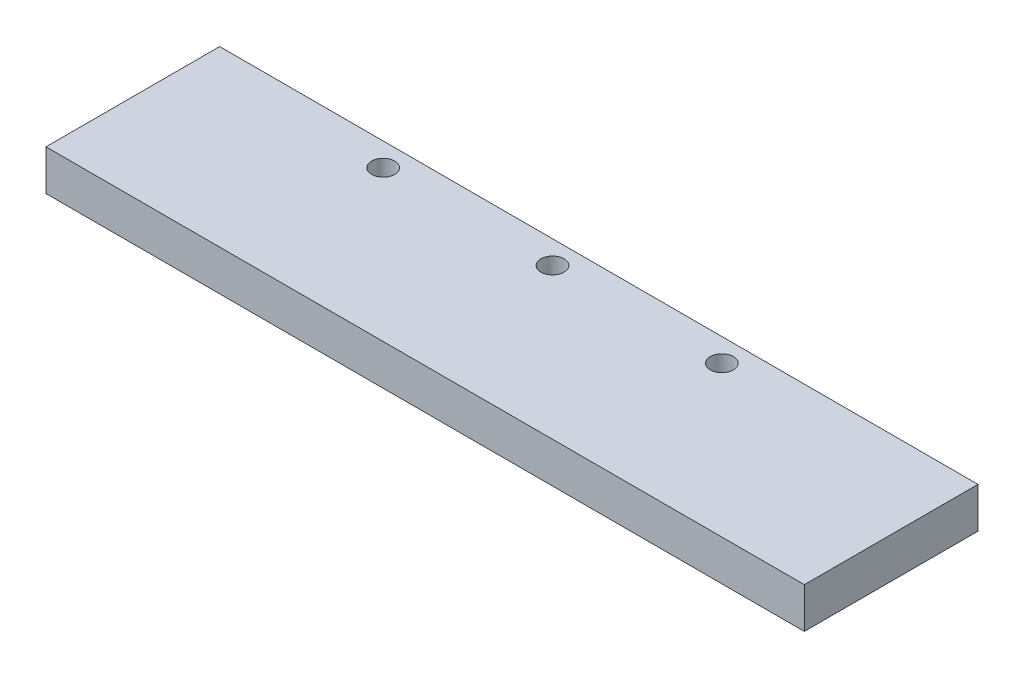
ISO-10303-21;
HEADER;
FILE_DESCRIPTION(('STEP AP214'),'2;1');
FILE_NAME('part.step','',(''),(''),'','','');
FILE_SCHEMA(('AUTOMOTIVE_DESIGN { 1 0 10303 214 1 1 1 1 }'));
ENDSEC;
DATA;
#1=APPLICATION_CONTEXT('core data for automotive mechanical design processes');
#2=APPLICATION_PROTOCOL_DEFINITION('international standard','automotive_design',2000,#1);
#3=PRODUCT_CONTEXT('',#1,'mechanical');
#4=PRODUCT('Part','Part','',(#3));
#5=PRODUCT_RELATED_PRODUCT_CATEGORY('part','',(#4));
#6=PRODUCT_DEFINITION_FORMATION('','',#4);
#7=PRODUCT_DEFINITION_CONTEXT('part definition',#1,'design');
#8=PRODUCT_DEFINITION('design','',#6,#7);
#9=PRODUCT_DEFINITION_SHAPE('','',#8);
#10=(LENGTH_UNIT() NAMED_UNIT(*) SI_UNIT(.MILLI.,.METRE.));
#11=(NAMED_UNIT(*) PLANE_ANGLE_UNIT() SI_UNIT($,.RADIAN.));
#12=(NAMED_UNIT(*) SI_UNIT($,.STERADIAN.) SOLID_ANGLE_UNIT());
#13=UNCERTAINTY_MEASURE_WITH_UNIT(LENGTH_MEASURE(1.E-05),#10,'distance_accuracy_value','');
#14=(GEOMETRIC_REPRESENTATION_CONTEXT(3) GLOBAL_UNCERTAINTY_ASSIGNED_CONTEXT((#13)) GLOBAL_UNIT_ASSIGNED_CONTEXT((#10,
#11,#12)) REPRESENTATION_CONTEXT('',''));
#15=CARTESIAN_POINT('',(0.,0.,0.));
#16=DIRECTION('',(0.,0.,1.));
#17=DIRECTION('',(1.,0.,0.));
#18=AXIS2_PLACEMENT_3D('',#15,#16,#17);
#19=CARTESIAN_POINT('',(-102.510460251046,7.,-65.1673640167364));
#20=DIRECTION('',(0.,0.,-1.));
#21=DIRECTION('',(-1.,0.,0.));
#22=AXIS2_PLACEMENT_3D('',#19,#20,#21);
#23=PLANE('',#22);
#24=DIRECTION('',(1.,0.,0.));
#25=VECTOR('',#24,1.);
#26=CARTESIAN_POINT('',(-102.510460251046,0.,-65.1673640167364));
#27=LINE('',#26,#25);
#28=CARTESIAN_POINT('',(-102.510460251046,0.,-65.1673640167364));
#29=VERTEX_POINT('',#28);
#30=CARTESIAN_POINT('',(28.4895397489539,0.,-65.1673640167364));
#31=VERTEX_POINT('',#30);
#32=EDGE_CURVE('E99',#29,#31,#27,.T.);
#33=ORIENTED_EDGE('',*,*,#32,.F.);
#34=DIRECTION('',(0.,-1.,0.));
#35=VECTOR('',#34,1.);
#36=CARTESIAN_POINT('',(-102.510460251046,7.,-65.1673640167364));
#37=LINE('',#36,#35);
#38=CARTESIAN_POINT('',(-102.510460251046,7.,-65.1673640167364));
#39=VERTEX_POINT('',#38);
#40=EDGE_CURVE('E11',#39,#29,#37,.T.);
#41=ORIENTED_EDGE('',*,*,#40,.F.);
#42=DIRECTION('',(1.,0.,0.));
#43=VECTOR('',#42,1.);
#44=CARTESIAN_POINT('',(-102.510460251046,7.,-65.1673640167364));
#45=LINE('',#44,#43);
#46=CARTESIAN_POINT('',(28.4895397489539,7.,-65.1673640167364));
#47=VERTEX_POINT('',#46);
#48=EDGE_CURVE('E93',#39,#47,#45,.T.);
#49=ORIENTED_EDGE('',*,*,#48,.T.);
#50=DIRECTION('',(0.,-1.,0.));
#51=VECTOR('',#50,1.);
#52=CARTESIAN_POINT('',(28.4895397489539,7.,-65.1673640167364));
#53=LINE('',#52,#51);
#54=EDGE_CURVE('E36',#47,#31,#53,.T.);
#55=ORIENTED_EDGE('',*,*,#54,.T.);
#56=EDGE_LOOP('',(#33,#41,#49,#55));
#57=FACE_BOUND('',#56,.T.);
#58=ADVANCED_FACE('F33',(#57),#23,.T.);
#59=CARTESIAN_POINT('',(-102.510460251046,7.,-65.1673640167364));
#60=DIRECTION('',(1.,0.,0.));
#61=DIRECTION('',(0.,0.,-1.));
#62=AXIS2_PLACEMENT_3D('',#59,#60,#61);
#63=PLANE('',#62);
#64=DIRECTION('',(0.,0.,1.));
#65=VECTOR('',#64,1.);
#66=CARTESIAN_POINT('',(-102.510460251046,0.,-65.1673640167364));
#67=LINE('',#66,#65);
#68=CARTESIAN_POINT('',(-102.510460251046,0.,-35.1673640167364));
#69=VERTEX_POINT('',#68);
#70=EDGE_CURVE('E66',#29,#69,#67,.T.);
#71=ORIENTED_EDGE('',*,*,#70,.T.);
#72=DIRECTION('',(0.,-1.,0.));
#73=VECTOR('',#72,1.);
#74=CARTESIAN_POINT('',(-102.510460251046,7.,-35.1673640167364));
#75=LINE('',#74,#73);
#76=CARTESIAN_POINT('',(-102.510460251046,7.,-35.1673640167364));
#77=VERTEX_POINT('',#76);
#78=EDGE_CURVE('E42',#77,#69,#75,.T.);
#79=ORIENTED_EDGE('',*,*,#78,.F.);
#80=DIRECTION('',(0.,0.,1.));
#81=VECTOR('',#80,1.);
#82=CARTESIAN_POINT('',(-102.510460251046,7.,-65.1673640167364));
#83=LINE('',#82,#81);
#84=EDGE_CURVE('E83',#39,#77,#83,.T.);
#85=ORIENTED_EDGE('',*,*,#84,.F.);
#86=ORIENTED_EDGE('',*,*,#40,.T.);
#87=EDGE_LOOP('',(#71,#79,#85,#86));
#88=FACE_BOUND('',#87,.T.);
#89=ADVANCED_FACE('F110',(#88),#63,.F.);
#90=CARTESIAN_POINT('',(-102.510460251046,7.,-35.1673640167364));
#91=DIRECTION('',(0.,0.,-1.));
#92=DIRECTION('',(-1.,0.,0.));
#93=AXIS2_PLACEMENT_3D('',#90,#91,#92);
#94=PLANE('',#93);
#95=DIRECTION('',(1.,0.,0.));
#96=VECTOR('',#95,1.);
#97=CARTESIAN_POINT('',(-102.510460251046,0.,-35.1673640167364));
#98=LINE('',#97,#96);
#99=CARTESIAN_POINT('',(28.4895397489539,0.,-35.1673640167364));
#100=VERTEX_POINT('',#99);
#101=EDGE_CURVE('E90',#69,#100,#98,.T.);
#102=ORIENTED_EDGE('',*,*,#101,.T.);
#103=DIRECTION('',(0.,-1.,0.));
#104=VECTOR('',#103,1.);
#105=CARTESIAN_POINT('',(28.4895397489539,7.,-35.1673640167364));
#106=LINE('',#105,#104);
#107=CARTESIAN_POINT('',(28.4895397489539,7.,-35.1673640167364));
#108=VERTEX_POINT('',#107);
#109=EDGE_CURVE('E87',#108,#100,#106,.T.);
#110=ORIENTED_EDGE('',*,*,#109,.F.);
#111=DIRECTION('',(1.,0.,0.));
#112=VECTOR('',#111,1.);
#113=CARTESIAN_POINT('',(-102.510460251046,7.,-35.1673640167364));
#114=LINE('',#113,#112);
#115=EDGE_CURVE('E78',#77,#108,#114,.T.);
#116=ORIENTED_EDGE('',*,*,#115,.F.);
#117=ORIENTED_EDGE('',*,*,#78,.T.);
#118=EDGE_LOOP('',(#102,#110,#116,#117));
#119=FACE_BOUND('',#118,.T.);
#120=ADVANCED_FACE('F88',(#119),#94,.F.);
#121=CARTESIAN_POINT('',(28.4895397489539,7.,-65.1673640167364));
#122=DIRECTION('',(1.,0.,0.));
#123=DIRECTION('',(0.,0.,-1.));
#124=AXIS2_PLACEMENT_3D('',#121,#122,#123);
#125=PLANE('',#124);
#126=DIRECTION('',(0.,0.,1.));
#127=VECTOR('',#126,1.);
#128=CARTESIAN_POINT('',(28.4895397489539,0.,-65.1673640167364));
#129=LINE('',#128,#127);
#130=EDGE_CURVE('E102',#31,#100,#129,.T.);
#131=ORIENTED_EDGE('',*,*,#130,.F.);
#132=ORIENTED_EDGE('',*,*,#54,.F.);
#133=DIRECTION('',(0.,0.,1.));
#134=VECTOR('',#133,1.);
#135=CARTESIAN_POINT('',(28.4895397489539,7.,-65.1673640167364));
#136=LINE('',#135,#134);
#137=EDGE_CURVE('E82',#47,#108,#136,.T.);
#138=ORIENTED_EDGE('',*,*,#137,.T.);
#139=ORIENTED_EDGE('',*,*,#109,.T.);
#140=EDGE_LOOP('',(#131,#132,#138,#139));
#141=FACE_BOUND('',#140,.T.);
#142=ADVANCED_FACE('F92',(#141),#125,.T.);
#143=CARTESIAN_POINT('',(0.,7.,0.));
#144=DIRECTION('',(0.,-1.,0.));
#145=DIRECTION('',(0.,0.,-1.));
#146=AXIS2_PLACEMENT_3D('',#143,#144,#145);
#147=PLANE('',#146);
#148=CARTESIAN_POINT('',(-70.2604602510461,7.,-61.1673640167364));
#149=DIRECTION('',(0.,-1.,0.));
#150=DIRECTION('',(0.,0.,-1.));
#151=AXIS2_PLACEMENT_3D('',#148,#149,#150);
#152=CIRCLE('',#151,2.);
#153=CARTESIAN_POINT('',(-70.2604602510461,7.,-63.1673640167364));
#154=VERTEX_POINT('',#153);
#155=EDGE_CURVE('E103',#154,#154,#152,.T.);
#156=ORIENTED_EDGE('',*,*,#155,.T.);
#157=EDGE_LOOP('',(#156));
#158=FACE_BOUND('',#157,.T.);
#159=CARTESIAN_POINT('',(-41.0104602510461,7.,-61.1673640167364));
#160=DIRECTION('',(0.,-1.,0.));
#161=DIRECTION('',(0.,0.,-1.));
#162=AXIS2_PLACEMENT_3D('',#159,#160,#161);
#163=CIRCLE('',#162,2.);
#164=CARTESIAN_POINT('',(-41.0104602510461,7.,-63.1673640167364));
#165=VERTEX_POINT('',#164);
#166=EDGE_CURVE('E151',#165,#165,#163,.T.);
#167=ORIENTED_EDGE('',*,*,#166,.T.);
#168=EDGE_LOOP('',(#167));
#169=FACE_BOUND('',#168,.T.);
#170=CARTESIAN_POINT('',(-11.7604602510461,7.,-61.1673640167364));
#171=DIRECTION('',(0.,-1.,0.));
#172=DIRECTION('',(0.,0.,-1.));
#173=AXIS2_PLACEMENT_3D('',#170,#171,#172);
#174=CIRCLE('',#173,2.);
#175=CARTESIAN_POINT('',(-11.7604602510461,7.,-63.1673640167364));
#176=VERTEX_POINT('',#175);
#177=EDGE_CURVE('E153',#176,#176,#174,.T.);
#178=ORIENTED_EDGE('',*,*,#177,.T.);
#179=EDGE_LOOP('',(#178));
#180=FACE_BOUND('',#179,.T.);
#181=ORIENTED_EDGE('',*,*,#48,.F.);
#182=ORIENTED_EDGE('',*,*,#84,.T.);
#183=ORIENTED_EDGE('',*,*,#115,.T.);
#184=ORIENTED_EDGE('',*,*,#137,.F.);
#185=EDGE_LOOP('',(#181,#182,#183,#184));
#186=FACE_BOUND('',#185,.T.);
#187=ADVANCED_FACE('F81',(#158,#169,#180,#186),#147,.F.);
#188=CARTESIAN_POINT('',(0.,0.,0.));
#189=DIRECTION('',(0.,-1.,0.));
#190=DIRECTION('',(0.,0.,-1.));
#191=AXIS2_PLACEMENT_3D('',#188,#189,#190);
#192=PLANE('',#191);
#193=CARTESIAN_POINT('',(-70.2604602510461,0.,-61.1673640167364));
#194=DIRECTION('',(0.,-1.,0.));
#195=DIRECTION('',(0.,0.,-1.));
#196=AXIS2_PLACEMENT_3D('',#193,#194,#195);
#197=CIRCLE('',#196,2.);
#198=CARTESIAN_POINT('',(-70.2604602510461,0.,-63.1673640167364));
#199=VERTEX_POINT('',#198);
#200=EDGE_CURVE('E149',#199,#199,#197,.T.);
#201=ORIENTED_EDGE('',*,*,#200,.F.);
#202=EDGE_LOOP('',(#201));
#203=FACE_BOUND('',#202,.T.);
#204=CARTESIAN_POINT('',(-41.0104602510461,0.,-61.1673640167364));
#205=DIRECTION('',(0.,-1.,0.));
#206=DIRECTION('',(0.,0.,-1.));
#207=AXIS2_PLACEMENT_3D('',#204,#205,#206);
#208=CIRCLE('',#207,2.);
#209=CARTESIAN_POINT('',(-41.0104602510461,0.,-63.1673640167364));
#210=VERTEX_POINT('',#209);
#211=EDGE_CURVE('E161',#210,#210,#208,.T.);
#212=ORIENTED_EDGE('',*,*,#211,.F.);
#213=EDGE_LOOP('',(#212));
#214=FACE_BOUND('',#213,.T.);
#215=CARTESIAN_POINT('',(-11.7604602510461,0.,-61.1673640167364));
#216=DIRECTION('',(0.,-1.,0.));
#217=DIRECTION('',(0.,0.,-1.));
#218=AXIS2_PLACEMENT_3D('',#215,#216,#217);
#219=CIRCLE('',#218,2.);
#220=CARTESIAN_POINT('',(-11.7604602510461,0.,-63.1673640167364));
#221=VERTEX_POINT('',#220);
#222=EDGE_CURVE('E158',#221,#221,#219,.T.);
#223=ORIENTED_EDGE('',*,*,#222,.F.);
#224=EDGE_LOOP('',(#223));
#225=FACE_BOUND('',#224,.T.);
#226=ORIENTED_EDGE('',*,*,#32,.T.);
#227=ORIENTED_EDGE('',*,*,#130,.T.);
#228=ORIENTED_EDGE('',*,*,#101,.F.);
#229=ORIENTED_EDGE('',*,*,#70,.F.);
#230=EDGE_LOOP('',(#226,#227,#228,#229));
#231=FACE_BOUND('',#230,.T.);
#232=ADVANCED_FACE('F108',(#203,#214,#225,#231),#192,.T.);
#233=CARTESIAN_POINT('',(-11.7604602510461,10.,-61.1673640167364));
#234=DIRECTION('',(0.,-1.,0.));
#235=DIRECTION('',(0.,0.,-1.));
#236=AXIS2_PLACEMENT_3D('',#233,#234,#235);
#237=CYLINDRICAL_SURFACE('',#236,2.);
#238=ORIENTED_EDGE('',*,*,#222,.T.);
#239=EDGE_LOOP('',(#238));
#240=FACE_BOUND('',#239,.T.);
#241=ORIENTED_EDGE('',*,*,#177,.F.);
#242=EDGE_LOOP('',(#241));
#243=FACE_BOUND('',#242,.T.);
#244=ADVANCED_FACE('F129',(#240,#243),#237,.F.);
#245=CARTESIAN_POINT('',(-41.0104602510461,10.,-61.1673640167364));
#246=DIRECTION('',(0.,-1.,0.));
#247=DIRECTION('',(0.,0.,-1.));
#248=AXIS2_PLACEMENT_3D('',#245,#246,#247);
#249=CYLINDRICAL_SURFACE('',#248,2.);
#250=ORIENTED_EDGE('',*,*,#211,.T.);
#251=EDGE_LOOP('',(#250));
#252=FACE_BOUND('',#251,.T.);
#253=ORIENTED_EDGE('',*,*,#166,.F.);
#254=EDGE_LOOP('',(#253));
#255=FACE_BOUND('',#254,.T.);
#256=ADVANCED_FACE('F136',(#252,#255),#249,.F.);
#257=CARTESIAN_POINT('',(-70.2604602510461,10.,-61.1673640167364));
#258=DIRECTION('',(0.,-1.,0.));
#259=DIRECTION('',(0.,0.,-1.));
#260=AXIS2_PLACEMENT_3D('',#257,#258,#259);
#261=CYLINDRICAL_SURFACE('',#260,2.);
#262=ORIENTED_EDGE('',*,*,#200,.T.);
#263=EDGE_LOOP('',(#262));
#264=FACE_BOUND('',#263,.T.);
#265=ORIENTED_EDGE('',*,*,#155,.F.);
#266=EDGE_LOOP('',(#265));
#267=FACE_BOUND('',#266,.T.);
#268=ADVANCED_FACE('F140',(#264,#267),#261,.F.);
#269=CLOSED_SHELL('',(#58,#89,#120,#142,#187,#232,#244,#256,#268));
#270=MANIFOLD_SOLID_BREP('B2',#269);
#271=ADVANCED_BREP_SHAPE_REPRESENTATION('',(#18,#270),#14);
#272=SHAPE_DEFINITION_REPRESENTATION(#9,#271);
ENDSEC;
END-ISO-10303-21;
